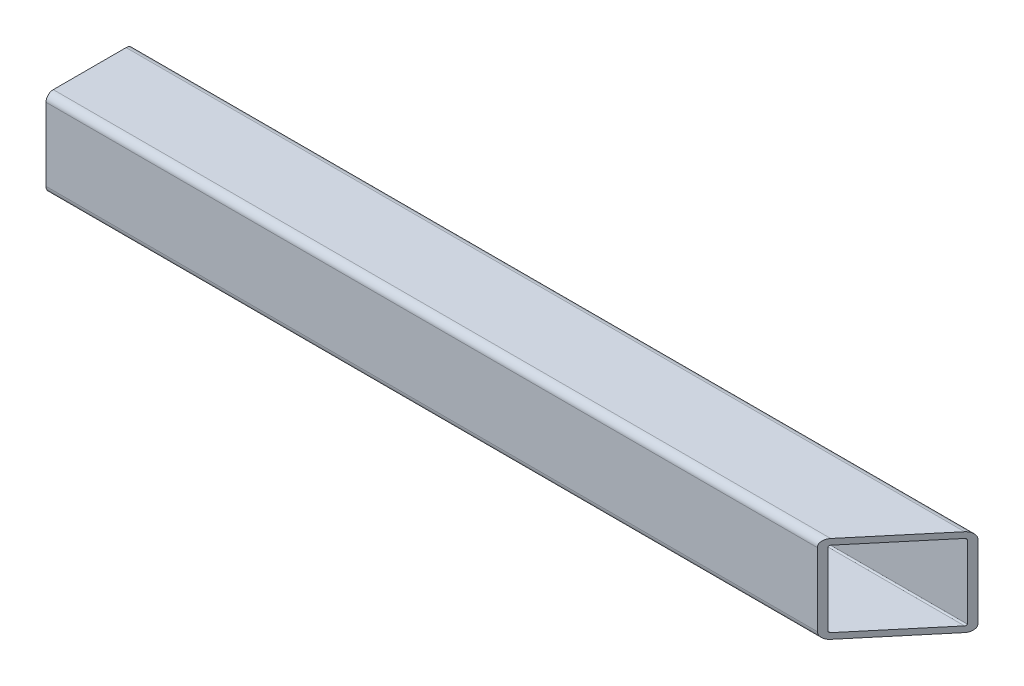
ISO-10303-21;
HEADER;
FILE_DESCRIPTION(('STEP AP214'),'2;1');
FILE_NAME('part.step','',(''),(''),'','','');
FILE_SCHEMA(('AUTOMOTIVE_DESIGN { 1 0 10303 214 1 1 1 1 }'));
ENDSEC;
DATA;
#1=APPLICATION_CONTEXT('core data for automotive mechanical design processes');
#2=APPLICATION_PROTOCOL_DEFINITION('international standard','automotive_design',2000,#1);
#3=PRODUCT_CONTEXT('',#1,'mechanical');
#4=PRODUCT('Part','Part','',(#3));
#5=PRODUCT_RELATED_PRODUCT_CATEGORY('part','',(#4));
#6=PRODUCT_DEFINITION_FORMATION('','',#4);
#7=PRODUCT_DEFINITION_CONTEXT('part definition',#1,'design');
#8=PRODUCT_DEFINITION('design','',#6,#7);
#9=PRODUCT_DEFINITION_SHAPE('','',#8);
#10=(LENGTH_UNIT() NAMED_UNIT(*) SI_UNIT(.MILLI.,.METRE.));
#11=(NAMED_UNIT(*) PLANE_ANGLE_UNIT() SI_UNIT($,.RADIAN.));
#12=(NAMED_UNIT(*) SI_UNIT($,.STERADIAN.) SOLID_ANGLE_UNIT());
#13=UNCERTAINTY_MEASURE_WITH_UNIT(LENGTH_MEASURE(1.E-05),#10,'distance_accuracy_value','');
#14=(GEOMETRIC_REPRESENTATION_CONTEXT(3) GLOBAL_UNCERTAINTY_ASSIGNED_CONTEXT((#13)) GLOBAL_UNIT_ASSIGNED_CONTEXT((#10,
#11,#12)) REPRESENTATION_CONTEXT('',''));
#15=CARTESIAN_POINT('',(0.,0.,0.));
#16=DIRECTION('',(0.,0.,1.));
#17=DIRECTION('',(1.,0.,0.));
#18=AXIS2_PLACEMENT_3D('',#15,#16,#17);
#19=CARTESIAN_POINT('',(184.15,-15.875,15.875));
#20=DIRECTION('',(-1.,0.,0.));
#21=DIRECTION('',(0.,0.,1.));
#22=AXIS2_PLACEMENT_3D('',#19,#20,#21);
#23=CYLINDRICAL_SURFACE('',#22,3.175);
#24=CARTESIAN_POINT('',(154.844445381133,-15.875,15.875));
#25=DIRECTION('',(0.766044443118977,0.,0.642787609686541));
#26=DIRECTION('',(-0.642787609686541,0.,0.766044443118977));
#27=AXIS2_PLACEMENT_3D('',#24,#25,#26);
#28=ELLIPSE('',#27,4.14466814363,3.175);
#29=CARTESIAN_POINT('',(152.180304052145,-15.875,19.05));
#30=VERTEX_POINT('',#29);
#31=CARTESIAN_POINT('',(154.844445381133,-19.05,15.875));
#32=VERTEX_POINT('',#31);
#33=EDGE_CURVE('E206',#30,#32,#28,.T.);
#34=ORIENTED_EDGE('',*,*,#33,.F.);
#35=DIRECTION('',(-1.,0.,0.));
#36=VECTOR('',#35,1.);
#37=CARTESIAN_POINT('',(184.15,-15.875,19.05));
#38=LINE('',#37,#36);
#39=CARTESIAN_POINT('',(-184.15,-15.875,19.05));
#40=VERTEX_POINT('',#39);
#41=EDGE_CURVE('E191',#30,#40,#38,.T.);
#42=ORIENTED_EDGE('',*,*,#41,.T.);
#43=CARTESIAN_POINT('',(-184.15,-15.875,15.875));
#44=DIRECTION('',(1.,0.,0.));
#45=DIRECTION('',(0.,0.,-1.));
#46=AXIS2_PLACEMENT_3D('',#43,#44,#45);
#47=CIRCLE('',#46,3.175);
#48=CARTESIAN_POINT('',(-184.15,-19.05,15.875));
#49=VERTEX_POINT('',#48);
#50=EDGE_CURVE('E284',#40,#49,#47,.T.);
#51=ORIENTED_EDGE('',*,*,#50,.T.);
#52=DIRECTION('',(-1.,0.,0.));
#53=VECTOR('',#52,1.);
#54=CARTESIAN_POINT('',(184.15,-19.05,15.875));
#55=LINE('',#54,#53);
#56=EDGE_CURVE('E87',#32,#49,#55,.T.);
#57=ORIENTED_EDGE('',*,*,#56,.F.);
#58=EDGE_LOOP('',(#34,#42,#51,#57));
#59=FACE_BOUND('',#58,.T.);
#60=ADVANCED_FACE('F80',(#59),#23,.T.);
#61=CARTESIAN_POINT('',(184.15,-19.05,15.875));
#62=DIRECTION('',(0.,1.,0.));
#63=DIRECTION('',(0.,0.,1.));
#64=AXIS2_PLACEMENT_3D('',#61,#62,#63);
#65=PLANE('',#64);
#66=DIRECTION('',(0.642787609686541,0.,-0.766044443118977));
#67=VECTOR('',#66,1.);
#68=CARTESIAN_POINT('',(166.952794613024,-19.05,1.4448313025087));
#69=LINE('',#68,#67);
#70=CARTESIAN_POINT('',(181.485858671012,-19.05,-15.875));
#71=VERTEX_POINT('',#70);
#72=EDGE_CURVE('E94',#32,#71,#69,.T.);
#73=ORIENTED_EDGE('',*,*,#72,.F.);
#74=ORIENTED_EDGE('',*,*,#56,.T.);
#75=DIRECTION('',(0.,0.,-1.));
#76=VECTOR('',#75,1.);
#77=CARTESIAN_POINT('',(-184.15,-19.05,15.875));
#78=LINE('',#77,#76);
#79=CARTESIAN_POINT('',(-184.15,-19.05,-15.875));
#80=VERTEX_POINT('',#79);
#81=EDGE_CURVE('E288',#49,#80,#78,.T.);
#82=ORIENTED_EDGE('',*,*,#81,.T.);
#83=DIRECTION('',(-1.,0.,0.));
#84=VECTOR('',#83,1.);
#85=CARTESIAN_POINT('',(184.15,-19.05,-15.875));
#86=LINE('',#85,#84);
#87=EDGE_CURVE('E316',#71,#80,#86,.T.);
#88=ORIENTED_EDGE('',*,*,#87,.F.);
#89=EDGE_LOOP('',(#73,#74,#82,#88));
#90=FACE_BOUND('',#89,.T.);
#91=ADVANCED_FACE('F318',(#90),#65,.F.);
#92=CARTESIAN_POINT('',(184.15,-15.875,-15.875));
#93=DIRECTION('',(-1.,0.,0.));
#94=DIRECTION('',(0.,0.,1.));
#95=AXIS2_PLACEMENT_3D('',#92,#93,#94);
#96=CYLINDRICAL_SURFACE('',#95,3.175);
#97=CARTESIAN_POINT('',(181.485858671012,-15.875,-15.875));
#98=DIRECTION('',(0.766044443118977,0.,0.642787609686541));
#99=DIRECTION('',(-0.642787609686541,0.,0.766044443118977));
#100=AXIS2_PLACEMENT_3D('',#97,#98,#99);
#101=ELLIPSE('',#100,4.14466814362999,3.175);
#102=CARTESIAN_POINT('',(184.15,-15.875,-19.05));
#103=VERTEX_POINT('',#102);
#104=EDGE_CURVE('E102',#71,#103,#101,.T.);
#105=ORIENTED_EDGE('',*,*,#104,.F.);
#106=ORIENTED_EDGE('',*,*,#87,.T.);
#107=CARTESIAN_POINT('',(-184.15,-15.875,-15.875));
#108=DIRECTION('',(1.,0.,0.));
#109=DIRECTION('',(0.,0.,-1.));
#110=AXIS2_PLACEMENT_3D('',#107,#108,#109);
#111=CIRCLE('',#110,3.175);
#112=CARTESIAN_POINT('',(-184.15,-15.875,-19.05));
#113=VERTEX_POINT('',#112);
#114=EDGE_CURVE('E291',#80,#113,#111,.T.);
#115=ORIENTED_EDGE('',*,*,#114,.T.);
#116=DIRECTION('',(-1.,0.,0.));
#117=VECTOR('',#116,1.);
#118=CARTESIAN_POINT('',(184.15,-15.875,-19.05));
#119=LINE('',#118,#117);
#120=EDGE_CURVE('E313',#103,#113,#119,.T.);
#121=ORIENTED_EDGE('',*,*,#120,.F.);
#122=EDGE_LOOP('',(#105,#106,#115,#121));
#123=FACE_BOUND('',#122,.T.);
#124=ADVANCED_FACE('F325',(#123),#96,.T.);
#125=CARTESIAN_POINT('',(184.15,15.875,-15.875));
#126=DIRECTION('',(-1.,0.,0.));
#127=DIRECTION('',(0.,0.,1.));
#128=AXIS2_PLACEMENT_3D('',#125,#126,#127);
#129=CYLINDRICAL_SURFACE('',#128,3.175);
#130=CARTESIAN_POINT('',(181.485858671012,15.875,-15.875));
#131=DIRECTION('',(0.766044443118977,0.,0.642787609686541));
#132=DIRECTION('',(-0.642787609686541,0.,0.766044443118977));
#133=AXIS2_PLACEMENT_3D('',#130,#131,#132);
#134=ELLIPSE('',#133,4.14466814363,3.175);
#135=CARTESIAN_POINT('',(184.15,15.875,-19.05));
#136=VERTEX_POINT('',#135);
#137=CARTESIAN_POINT('',(181.485858671012,19.05,-15.875));
#138=VERTEX_POINT('',#137);
#139=EDGE_CURVE('E240',#136,#138,#134,.T.);
#140=ORIENTED_EDGE('',*,*,#139,.F.);
#141=DIRECTION('',(-1.,0.,0.));
#142=VECTOR('',#141,1.);
#143=CARTESIAN_POINT('',(184.15,15.875,-19.05));
#144=LINE('',#143,#142);
#145=CARTESIAN_POINT('',(-184.15,15.875,-19.05));
#146=VERTEX_POINT('',#145);
#147=EDGE_CURVE('E310',#136,#146,#144,.T.);
#148=ORIENTED_EDGE('',*,*,#147,.T.);
#149=CARTESIAN_POINT('',(-184.15,15.875,-15.875));
#150=DIRECTION('',(1.,0.,0.));
#151=DIRECTION('',(0.,0.,-1.));
#152=AXIS2_PLACEMENT_3D('',#149,#150,#151);
#153=CIRCLE('',#152,3.175);
#154=CARTESIAN_POINT('',(-184.15,19.05,-15.875));
#155=VERTEX_POINT('',#154);
#156=EDGE_CURVE('E295',#146,#155,#153,.T.);
#157=ORIENTED_EDGE('',*,*,#156,.T.);
#158=DIRECTION('',(-1.,0.,0.));
#159=VECTOR('',#158,1.);
#160=CARTESIAN_POINT('',(184.15,19.05,-15.875));
#161=LINE('',#160,#159);
#162=EDGE_CURVE('E308',#138,#155,#161,.T.);
#163=ORIENTED_EDGE('',*,*,#162,.F.);
#164=EDGE_LOOP('',(#140,#148,#157,#163));
#165=FACE_BOUND('',#164,.T.);
#166=ADVANCED_FACE('F332',(#165),#129,.T.);
#167=CARTESIAN_POINT('',(184.15,19.05,15.875));
#168=DIRECTION('',(0.,-1.,0.));
#169=DIRECTION('',(0.,0.,-1.));
#170=AXIS2_PLACEMENT_3D('',#167,#168,#169);
#171=PLANE('',#170);
#172=DIRECTION('',(-0.642787609686541,0.,0.766044443118977));
#173=VECTOR('',#172,1.);
#174=CARTESIAN_POINT('',(166.952794613024,19.05,1.4448313025087));
#175=LINE('',#174,#173);
#176=CARTESIAN_POINT('',(154.844445381133,19.05,15.875));
#177=VERTEX_POINT('',#176);
#178=EDGE_CURVE('E238',#138,#177,#175,.T.);
#179=ORIENTED_EDGE('',*,*,#178,.F.);
#180=ORIENTED_EDGE('',*,*,#162,.T.);
#181=DIRECTION('',(0.,0.,1.));
#182=VECTOR('',#181,1.);
#183=CARTESIAN_POINT('',(-184.15,19.05,15.875));
#184=LINE('',#183,#182);
#185=CARTESIAN_POINT('',(-184.15,19.05,15.875));
#186=VERTEX_POINT('',#185);
#187=EDGE_CURVE('E298',#155,#186,#184,.T.);
#188=ORIENTED_EDGE('',*,*,#187,.T.);
#189=DIRECTION('',(-1.,0.,0.));
#190=VECTOR('',#189,1.);
#191=CARTESIAN_POINT('',(184.15,19.05,15.875));
#192=LINE('',#191,#190);
#193=EDGE_CURVE('E306',#177,#186,#192,.T.);
#194=ORIENTED_EDGE('',*,*,#193,.F.);
#195=EDGE_LOOP('',(#179,#180,#188,#194));
#196=FACE_BOUND('',#195,.T.);
#197=ADVANCED_FACE('F335',(#196),#171,.F.);
#198=CARTESIAN_POINT('',(184.15,15.875,15.875));
#199=DIRECTION('',(-1.,0.,0.));
#200=DIRECTION('',(0.,0.,1.));
#201=AXIS2_PLACEMENT_3D('',#198,#199,#200);
#202=CYLINDRICAL_SURFACE('',#201,3.175);
#203=CARTESIAN_POINT('',(154.844445381133,15.875,15.875));
#204=DIRECTION('',(0.766044443118977,0.,0.642787609686541));
#205=DIRECTION('',(-0.642787609686541,0.,0.766044443118977));
#206=AXIS2_PLACEMENT_3D('',#203,#204,#205);
#207=ELLIPSE('',#206,4.14466814363,3.175);
#208=CARTESIAN_POINT('',(152.180304052145,15.875,19.05));
#209=VERTEX_POINT('',#208);
#210=EDGE_CURVE('E213',#177,#209,#207,.T.);
#211=ORIENTED_EDGE('',*,*,#210,.F.);
#212=ORIENTED_EDGE('',*,*,#193,.T.);
#213=CARTESIAN_POINT('',(-184.15,15.875,15.875));
#214=DIRECTION('',(1.,0.,0.));
#215=DIRECTION('',(0.,0.,-1.));
#216=AXIS2_PLACEMENT_3D('',#213,#214,#215);
#217=CIRCLE('',#216,3.175);
#218=CARTESIAN_POINT('',(-184.15,15.875,19.05));
#219=VERTEX_POINT('',#218);
#220=EDGE_CURVE('E301',#186,#219,#217,.T.);
#221=ORIENTED_EDGE('',*,*,#220,.T.);
#222=DIRECTION('',(-1.,0.,0.));
#223=VECTOR('',#222,1.);
#224=CARTESIAN_POINT('',(184.15,15.875,19.05));
#225=LINE('',#224,#223);
#226=EDGE_CURVE('E202',#209,#219,#225,.T.);
#227=ORIENTED_EDGE('',*,*,#226,.F.);
#228=EDGE_LOOP('',(#211,#212,#221,#227));
#229=FACE_BOUND('',#228,.T.);
#230=ADVANCED_FACE('F339',(#229),#202,.T.);
#231=CARTESIAN_POINT('',(184.15,15.875,19.05));
#232=DIRECTION('',(0.,0.,-1.));
#233=DIRECTION('',(0.,1.,0.));
#234=AXIS2_PLACEMENT_3D('',#231,#232,#233);
#235=PLANE('',#234);
#236=DIRECTION('',(0.,-1.,0.));
#237=VECTOR('',#236,1.);
#238=CARTESIAN_POINT('',(152.180304052145,531.950640749653,19.05));
#239=LINE('',#238,#237);
#240=EDGE_CURVE('E195',#209,#30,#239,.T.);
#241=ORIENTED_EDGE('',*,*,#240,.F.);
#242=ORIENTED_EDGE('',*,*,#226,.T.);
#243=DIRECTION('',(0.,-1.,0.));
#244=VECTOR('',#243,1.);
#245=CARTESIAN_POINT('',(-184.15,15.875,19.05));
#246=LINE('',#245,#244);
#247=EDGE_CURVE('E198',#219,#40,#246,.T.);
#248=ORIENTED_EDGE('',*,*,#247,.T.);
#249=ORIENTED_EDGE('',*,*,#41,.F.);
#250=EDGE_LOOP('',(#241,#242,#248,#249));
#251=FACE_BOUND('',#250,.T.);
#252=ADVANCED_FACE('F193',(#251),#235,.F.);
#253=CARTESIAN_POINT('',(184.15,-15.875,15.875));
#254=DIRECTION('',(-1.,0.,0.));
#255=DIRECTION('',(0.,0.,1.));
#256=AXIS2_PLACEMENT_3D('',#253,#254,#255);
#257=CYLINDRICAL_SURFACE('',#256,0.635000000000002);
#258=DIRECTION('',(-1.,0.,0.));
#259=VECTOR('',#258,1.);
#260=CARTESIAN_POINT('',(184.15,-15.875,16.51));
#261=LINE('',#260,#259);
#262=CARTESIAN_POINT('',(154.311617115336,-15.875,16.51));
#263=VERTEX_POINT('',#262);
#264=CARTESIAN_POINT('',(-184.15,-15.875,16.51));
#265=VERTEX_POINT('',#264);
#266=EDGE_CURVE('E268',#263,#265,#261,.T.);
#267=ORIENTED_EDGE('',*,*,#266,.F.);
#268=CARTESIAN_POINT('',(154.844445381133,-15.875,15.875));
#269=DIRECTION('',(0.766044443118977,0.,0.642787609686541));
#270=DIRECTION('',(-0.642787609686541,0.,0.766044443118977));
#271=AXIS2_PLACEMENT_3D('',#268,#269,#270);
#272=ELLIPSE('',#271,0.828933628726001,0.635000000000002);
#273=CARTESIAN_POINT('',(154.844445381133,-16.51,15.875));
#274=VERTEX_POINT('',#273);
#275=EDGE_CURVE('E234',#263,#274,#272,.T.);
#276=ORIENTED_EDGE('',*,*,#275,.T.);
#277=DIRECTION('',(-1.,0.,0.));
#278=VECTOR('',#277,1.);
#279=CARTESIAN_POINT('',(184.15,-16.51,15.875));
#280=LINE('',#279,#278);
#281=CARTESIAN_POINT('',(-184.15,-16.51,15.875));
#282=VERTEX_POINT('',#281);
#283=EDGE_CURVE('E282',#274,#282,#280,.T.);
#284=ORIENTED_EDGE('',*,*,#283,.T.);
#285=CARTESIAN_POINT('',(-184.15,-15.875,15.875));
#286=DIRECTION('',(1.,0.,0.));
#287=DIRECTION('',(0.,0.,-1.));
#288=AXIS2_PLACEMENT_3D('',#285,#286,#287);
#289=CIRCLE('',#288,0.635000000000002);
#290=EDGE_CURVE('E208',#265,#282,#289,.T.);
#291=ORIENTED_EDGE('',*,*,#290,.F.);
#292=EDGE_LOOP('',(#267,#276,#284,#291));
#293=FACE_BOUND('',#292,.T.);
#294=ADVANCED_FACE('F346',(#293),#257,.F.);
#295=CARTESIAN_POINT('',(184.15,-16.51,15.875));
#296=DIRECTION('',(0.,1.,0.));
#297=DIRECTION('',(0.,0.,1.));
#298=AXIS2_PLACEMENT_3D('',#295,#296,#297);
#299=PLANE('',#298);
#300=ORIENTED_EDGE('',*,*,#283,.F.);
#301=DIRECTION('',(0.642787609686541,0.,-0.766044443118977));
#302=VECTOR('',#301,1.);
#303=CARTESIAN_POINT('',(166.952794613024,-16.51,1.4448313025087));
#304=LINE('',#303,#302);
#305=CARTESIAN_POINT('',(181.485858671012,-16.51,-15.875));
#306=VERTEX_POINT('',#305);
#307=EDGE_CURVE('E231',#274,#306,#304,.T.);
#308=ORIENTED_EDGE('',*,*,#307,.T.);
#309=DIRECTION('',(-1.,0.,0.));
#310=VECTOR('',#309,1.);
#311=CARTESIAN_POINT('',(184.15,-16.51,-15.875));
#312=LINE('',#311,#310);
#313=CARTESIAN_POINT('',(-184.15,-16.51,-15.875));
#314=VERTEX_POINT('',#313);
#315=EDGE_CURVE('E280',#306,#314,#312,.T.);
#316=ORIENTED_EDGE('',*,*,#315,.T.);
#317=DIRECTION('',(0.,0.,-1.));
#318=VECTOR('',#317,1.);
#319=CARTESIAN_POINT('',(-184.15,-16.51,15.875));
#320=LINE('',#319,#318);
#321=EDGE_CURVE('E247',#282,#314,#320,.T.);
#322=ORIENTED_EDGE('',*,*,#321,.F.);
#323=EDGE_LOOP('',(#300,#308,#316,#322));
#324=FACE_BOUND('',#323,.T.);
#325=ADVANCED_FACE('F388',(#324),#299,.T.);
#326=CARTESIAN_POINT('',(184.15,-15.875,-15.875));
#327=DIRECTION('',(-1.,0.,0.));
#328=DIRECTION('',(0.,0.,1.));
#329=AXIS2_PLACEMENT_3D('',#326,#327,#328);
#330=CYLINDRICAL_SURFACE('',#329,0.634999999999999);
#331=ORIENTED_EDGE('',*,*,#315,.F.);
#332=CARTESIAN_POINT('',(181.485858671012,-15.875,-15.875));
#333=DIRECTION('',(0.766044443118977,0.,0.642787609686541));
#334=DIRECTION('',(-0.642787609686541,0.,0.766044443118977));
#335=AXIS2_PLACEMENT_3D('',#332,#333,#334);
#336=ELLIPSE('',#335,0.828933628725997,0.634999999999999);
#337=CARTESIAN_POINT('',(182.01868693681,-15.875,-16.51));
#338=VERTEX_POINT('',#337);
#339=EDGE_CURVE('E228',#306,#338,#336,.T.);
#340=ORIENTED_EDGE('',*,*,#339,.T.);
#341=DIRECTION('',(-1.,0.,0.));
#342=VECTOR('',#341,1.);
#343=CARTESIAN_POINT('',(184.15,-15.875,-16.51));
#344=LINE('',#343,#342);
#345=CARTESIAN_POINT('',(-184.15,-15.875,-16.51));
#346=VERTEX_POINT('',#345);
#347=EDGE_CURVE('E278',#338,#346,#344,.T.);
#348=ORIENTED_EDGE('',*,*,#347,.T.);
#349=CARTESIAN_POINT('',(-184.15,-15.875,-15.875));
#350=DIRECTION('',(1.,0.,0.));
#351=DIRECTION('',(0.,0.,-1.));
#352=AXIS2_PLACEMENT_3D('',#349,#350,#351);
#353=CIRCLE('',#352,0.634999999999999);
#354=EDGE_CURVE('E250',#314,#346,#353,.T.);
#355=ORIENTED_EDGE('',*,*,#354,.F.);
#356=EDGE_LOOP('',(#331,#340,#348,#355));
#357=FACE_BOUND('',#356,.T.);
#358=ADVANCED_FACE('F398',(#357),#330,.F.);
#359=CARTESIAN_POINT('',(184.15,15.875,-16.51));
#360=DIRECTION('',(0.,0.,1.));
#361=DIRECTION('',(0.,-1.,0.));
#362=AXIS2_PLACEMENT_3D('',#359,#360,#361);
#363=PLANE('',#362);
#364=ORIENTED_EDGE('',*,*,#347,.F.);
#365=DIRECTION('',(0.,1.,0.));
#366=VECTOR('',#365,1.);
#367=CARTESIAN_POINT('',(182.01868693681,15.875,-16.51));
#368=LINE('',#367,#366);
#369=CARTESIAN_POINT('',(182.01868693681,15.875,-16.51));
#370=VERTEX_POINT('',#369);
#371=EDGE_CURVE('E225',#338,#370,#368,.T.);
#372=ORIENTED_EDGE('',*,*,#371,.T.);
#373=DIRECTION('',(-1.,0.,0.));
#374=VECTOR('',#373,1.);
#375=CARTESIAN_POINT('',(184.15,15.875,-16.51));
#376=LINE('',#375,#374);
#377=CARTESIAN_POINT('',(-184.15,15.875,-16.51));
#378=VERTEX_POINT('',#377);
#379=EDGE_CURVE('E276',#370,#378,#376,.T.);
#380=ORIENTED_EDGE('',*,*,#379,.T.);
#381=DIRECTION('',(0.,1.,0.));
#382=VECTOR('',#381,1.);
#383=CARTESIAN_POINT('',(-184.15,15.875,-16.51));
#384=LINE('',#383,#382);
#385=EDGE_CURVE('E253',#346,#378,#384,.T.);
#386=ORIENTED_EDGE('',*,*,#385,.F.);
#387=EDGE_LOOP('',(#364,#372,#380,#386));
#388=FACE_BOUND('',#387,.T.);
#389=ADVANCED_FACE('F408',(#388),#363,.T.);
#390=CARTESIAN_POINT('',(184.15,15.875,-15.875));
#391=DIRECTION('',(-1.,0.,0.));
#392=DIRECTION('',(0.,0.,1.));
#393=AXIS2_PLACEMENT_3D('',#390,#391,#392);
#394=CYLINDRICAL_SURFACE('',#393,0.635000000000004);
#395=ORIENTED_EDGE('',*,*,#379,.F.);
#396=CARTESIAN_POINT('',(181.485858671012,15.875,-15.875));
#397=DIRECTION('',(0.766044443118977,0.,0.642787609686541));
#398=DIRECTION('',(-0.642787609686541,0.,0.766044443118977));
#399=AXIS2_PLACEMENT_3D('',#396,#397,#398);
#400=ELLIPSE('',#399,0.828933628726004,0.635000000000004);
#401=CARTESIAN_POINT('',(181.485858671012,16.51,-15.875));
#402=VERTEX_POINT('',#401);
#403=EDGE_CURVE('E222',#370,#402,#400,.T.);
#404=ORIENTED_EDGE('',*,*,#403,.T.);
#405=DIRECTION('',(-1.,0.,0.));
#406=VECTOR('',#405,1.);
#407=CARTESIAN_POINT('',(184.15,16.51,-15.875));
#408=LINE('',#407,#406);
#409=CARTESIAN_POINT('',(-184.15,16.51,-15.875));
#410=VERTEX_POINT('',#409);
#411=EDGE_CURVE('E274',#402,#410,#408,.T.);
#412=ORIENTED_EDGE('',*,*,#411,.T.);
#413=CARTESIAN_POINT('',(-184.15,15.875,-15.875));
#414=DIRECTION('',(1.,0.,0.));
#415=DIRECTION('',(0.,0.,-1.));
#416=AXIS2_PLACEMENT_3D('',#413,#414,#415);
#417=CIRCLE('',#416,0.635000000000004);
#418=EDGE_CURVE('E256',#378,#410,#417,.T.);
#419=ORIENTED_EDGE('',*,*,#418,.F.);
#420=EDGE_LOOP('',(#395,#404,#412,#419));
#421=FACE_BOUND('',#420,.T.);
#422=ADVANCED_FACE('F418',(#421),#394,.F.);
#423=CARTESIAN_POINT('',(184.15,16.51,15.875));
#424=DIRECTION('',(0.,-1.,0.));
#425=DIRECTION('',(0.,0.,-1.));
#426=AXIS2_PLACEMENT_3D('',#423,#424,#425);
#427=PLANE('',#426);
#428=ORIENTED_EDGE('',*,*,#411,.F.);
#429=DIRECTION('',(-0.642787609686541,0.,0.766044443118977));
#430=VECTOR('',#429,1.);
#431=CARTESIAN_POINT('',(166.952794613024,16.51,1.4448313025087));
#432=LINE('',#431,#430);
#433=CARTESIAN_POINT('',(154.844445381133,16.51,15.875));
#434=VERTEX_POINT('',#433);
#435=EDGE_CURVE('E217',#402,#434,#432,.T.);
#436=ORIENTED_EDGE('',*,*,#435,.T.);
#437=DIRECTION('',(-1.,0.,0.));
#438=VECTOR('',#437,1.);
#439=CARTESIAN_POINT('',(184.15,16.51,15.875));
#440=LINE('',#439,#438);
#441=CARTESIAN_POINT('',(-184.15,16.51,15.875));
#442=VERTEX_POINT('',#441);
#443=EDGE_CURVE('E272',#434,#442,#440,.T.);
#444=ORIENTED_EDGE('',*,*,#443,.T.);
#445=DIRECTION('',(0.,0.,1.));
#446=VECTOR('',#445,1.);
#447=CARTESIAN_POINT('',(-184.15,16.51,15.875));
#448=LINE('',#447,#446);
#449=EDGE_CURVE('E259',#410,#442,#448,.T.);
#450=ORIENTED_EDGE('',*,*,#449,.F.);
#451=EDGE_LOOP('',(#428,#436,#444,#450));
#452=FACE_BOUND('',#451,.T.);
#453=ADVANCED_FACE('F428',(#452),#427,.T.);
#454=CARTESIAN_POINT('',(184.15,15.875,15.875));
#455=DIRECTION('',(-1.,0.,0.));
#456=DIRECTION('',(0.,0.,1.));
#457=AXIS2_PLACEMENT_3D('',#454,#455,#456);
#458=CYLINDRICAL_SURFACE('',#457,0.635000000000004);
#459=ORIENTED_EDGE('',*,*,#443,.F.);
#460=CARTESIAN_POINT('',(154.844445381133,15.875,15.875));
#461=DIRECTION('',(0.766044443118977,0.,0.642787609686541));
#462=DIRECTION('',(-0.642787609686541,0.,0.766044443118977));
#463=AXIS2_PLACEMENT_3D('',#460,#461,#462);
#464=ELLIPSE('',#463,0.828933628726004,0.635000000000004);
#465=CARTESIAN_POINT('',(154.311617115336,15.875,16.51));
#466=VERTEX_POINT('',#465);
#467=EDGE_CURVE('E214',#434,#466,#464,.T.);
#468=ORIENTED_EDGE('',*,*,#467,.T.);
#469=DIRECTION('',(-1.,0.,0.));
#470=VECTOR('',#469,1.);
#471=CARTESIAN_POINT('',(184.15,15.875,16.51));
#472=LINE('',#471,#470);
#473=CARTESIAN_POINT('',(-184.15,15.875,16.51));
#474=VERTEX_POINT('',#473);
#475=EDGE_CURVE('E270',#466,#474,#472,.T.);
#476=ORIENTED_EDGE('',*,*,#475,.T.);
#477=CARTESIAN_POINT('',(-184.15,15.875,15.875));
#478=DIRECTION('',(1.,0.,0.));
#479=DIRECTION('',(0.,0.,-1.));
#480=AXIS2_PLACEMENT_3D('',#477,#478,#479);
#481=CIRCLE('',#480,0.635000000000004);
#482=EDGE_CURVE('E262',#442,#474,#481,.T.);
#483=ORIENTED_EDGE('',*,*,#482,.F.);
#484=EDGE_LOOP('',(#459,#468,#476,#483));
#485=FACE_BOUND('',#484,.T.);
#486=ADVANCED_FACE('F438',(#485),#458,.F.);
#487=CARTESIAN_POINT('',(184.15,15.875,16.51));
#488=DIRECTION('',(0.,0.,-1.));
#489=DIRECTION('',(0.,1.,0.));
#490=AXIS2_PLACEMENT_3D('',#487,#488,#489);
#491=PLANE('',#490);
#492=ORIENTED_EDGE('',*,*,#475,.F.);
#493=DIRECTION('',(0.,-1.,0.));
#494=VECTOR('',#493,1.);
#495=CARTESIAN_POINT('',(154.311617115336,15.875,16.51));
#496=LINE('',#495,#494);
#497=EDGE_CURVE('E12',#466,#263,#496,.T.);
#498=ORIENTED_EDGE('',*,*,#497,.T.);
#499=ORIENTED_EDGE('',*,*,#266,.T.);
#500=DIRECTION('',(0.,-1.,0.));
#501=VECTOR('',#500,1.);
#502=CARTESIAN_POINT('',(-184.15,15.875,16.51));
#503=LINE('',#502,#501);
#504=EDGE_CURVE('E265',#474,#265,#503,.T.);
#505=ORIENTED_EDGE('',*,*,#504,.F.);
#506=EDGE_LOOP('',(#492,#498,#499,#505));
#507=FACE_BOUND('',#506,.T.);
#508=ADVANCED_FACE('F448',(#507),#491,.T.);
#509=CARTESIAN_POINT('',(-184.15,-15.875,15.875));
#510=DIRECTION('',(1.,0.,0.));
#511=DIRECTION('',(0.,0.,-1.));
#512=AXIS2_PLACEMENT_3D('',#509,#510,#511);
#513=PLANE('',#512);
#514=ORIENTED_EDGE('',*,*,#50,.F.);
#515=ORIENTED_EDGE('',*,*,#247,.F.);
#516=ORIENTED_EDGE('',*,*,#220,.F.);
#517=ORIENTED_EDGE('',*,*,#187,.F.);
#518=ORIENTED_EDGE('',*,*,#156,.F.);
#519=DIRECTION('',(0.,1.,0.));
#520=VECTOR('',#519,1.);
#521=CARTESIAN_POINT('',(-184.15,15.875,-19.05));
#522=LINE('',#521,#520);
#523=EDGE_CURVE('E293',#113,#146,#522,.T.);
#524=ORIENTED_EDGE('',*,*,#523,.F.);
#525=ORIENTED_EDGE('',*,*,#114,.F.);
#526=ORIENTED_EDGE('',*,*,#81,.F.);
#527=EDGE_LOOP('',(#514,#515,#516,#517,#518,#524,#525,#526));
#528=FACE_BOUND('',#527,.T.);
#529=ORIENTED_EDGE('',*,*,#290,.T.);
#530=ORIENTED_EDGE('',*,*,#321,.T.);
#531=ORIENTED_EDGE('',*,*,#354,.T.);
#532=ORIENTED_EDGE('',*,*,#385,.T.);
#533=ORIENTED_EDGE('',*,*,#418,.T.);
#534=ORIENTED_EDGE('',*,*,#449,.T.);
#535=ORIENTED_EDGE('',*,*,#482,.T.);
#536=ORIENTED_EDGE('',*,*,#504,.T.);
#537=EDGE_LOOP('',(#529,#530,#531,#532,#533,#534,#535,#536));
#538=FACE_BOUND('',#537,.T.);
#539=ADVANCED_FACE('F321',(#528,#538),#513,.F.);
#540=CARTESIAN_POINT('',(184.15,15.875,-19.05));
#541=DIRECTION('',(0.,0.,1.));
#542=DIRECTION('',(0.,-1.,0.));
#543=AXIS2_PLACEMENT_3D('',#540,#541,#542);
#544=PLANE('',#543);
#545=ORIENTED_EDGE('',*,*,#523,.T.);
#546=ORIENTED_EDGE('',*,*,#147,.F.);
#547=DIRECTION('',(0.,1.,0.));
#548=VECTOR('',#547,1.);
#549=CARTESIAN_POINT('',(184.15,15.875,-19.05));
#550=LINE('',#549,#548);
#551=EDGE_CURVE('E203',#103,#136,#550,.T.);
#552=ORIENTED_EDGE('',*,*,#551,.F.);
#553=ORIENTED_EDGE('',*,*,#120,.T.);
#554=EDGE_LOOP('',(#545,#546,#552,#553));
#555=FACE_BOUND('',#554,.T.);
#556=ADVANCED_FACE('F328',(#555),#544,.F.);
#557=CARTESIAN_POINT('',(184.15,531.950640749653,-19.05));
#558=DIRECTION('',(0.766044443118977,0.,0.642787609686541));
#559=DIRECTION('',(0.642787609686541,0.,-0.766044443118977));
#560=AXIS2_PLACEMENT_3D('',#557,#558,#559);
#561=PLANE('',#560);
#562=ORIENTED_EDGE('',*,*,#275,.F.);
#563=ORIENTED_EDGE('',*,*,#497,.F.);
#564=ORIENTED_EDGE('',*,*,#467,.F.);
#565=ORIENTED_EDGE('',*,*,#435,.F.);
#566=ORIENTED_EDGE('',*,*,#403,.F.);
#567=ORIENTED_EDGE('',*,*,#371,.F.);
#568=ORIENTED_EDGE('',*,*,#339,.F.);
#569=ORIENTED_EDGE('',*,*,#307,.F.);
#570=EDGE_LOOP('',(#562,#563,#564,#565,#566,#567,#568,#569));
#571=FACE_BOUND('',#570,.T.);
#572=ORIENTED_EDGE('',*,*,#240,.T.);
#573=ORIENTED_EDGE('',*,*,#33,.T.);
#574=ORIENTED_EDGE('',*,*,#72,.T.);
#575=ORIENTED_EDGE('',*,*,#104,.T.);
#576=ORIENTED_EDGE('',*,*,#551,.T.);
#577=ORIENTED_EDGE('',*,*,#139,.T.);
#578=ORIENTED_EDGE('',*,*,#178,.T.);
#579=ORIENTED_EDGE('',*,*,#210,.T.);
#580=EDGE_LOOP('',(#572,#573,#574,#575,#576,#577,#578,#579));
#581=FACE_BOUND('',#580,.T.);
#582=ADVANCED_FACE('F211',(#571,#581),#561,.T.);
#583=CLOSED_SHELL('',(#60,#91,#124,#166,#197,#230,#252,#294,#325,#358,#389,#422,#453,#486,#508,
#539,#556,#582));
#584=MANIFOLD_SOLID_BREP('B2',#583);
#585=ADVANCED_BREP_SHAPE_REPRESENTATION('',(#18,#584),#14);
#586=SHAPE_DEFINITION_REPRESENTATION(#9,#585);
ENDSEC;
END-ISO-10303-21;
